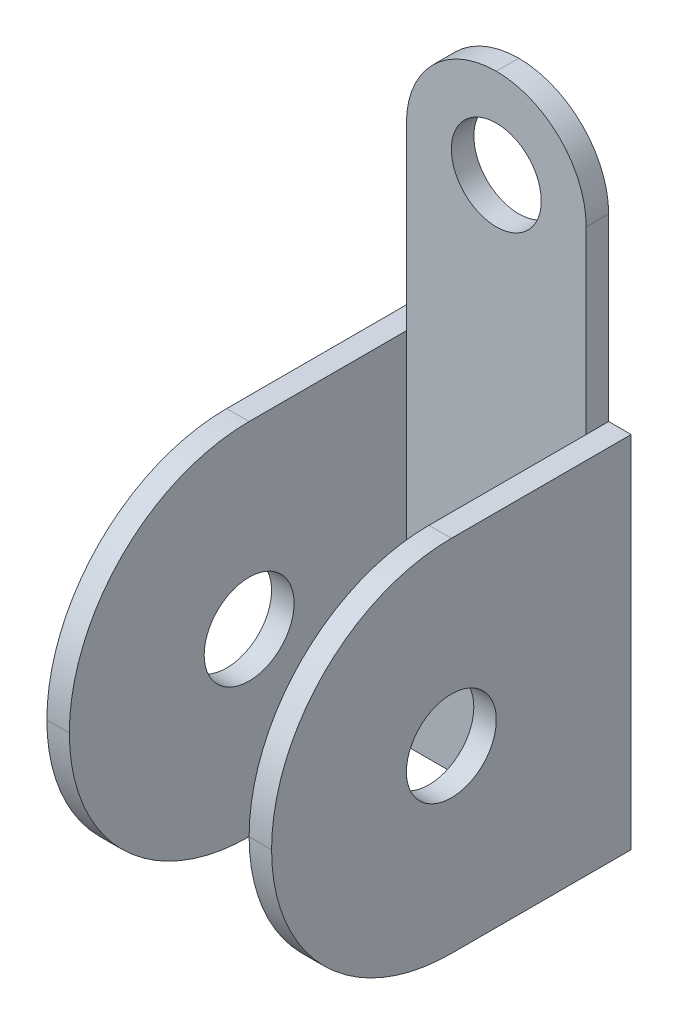
ISO-10303-21;
HEADER;
FILE_DESCRIPTION(('STEP AP214'),'2;1');
FILE_NAME('part.step','',(''),(''),'','','');
FILE_SCHEMA(('AUTOMOTIVE_DESIGN { 1 0 10303 214 1 1 1 1 }'));
ENDSEC;
DATA;
#1=APPLICATION_CONTEXT('core data for automotive mechanical design processes');
#2=APPLICATION_PROTOCOL_DEFINITION('international standard','automotive_design',2000,#1);
#3=PRODUCT_CONTEXT('',#1,'mechanical');
#4=PRODUCT('Part','Part','',(#3));
#5=PRODUCT_RELATED_PRODUCT_CATEGORY('part','',(#4));
#6=PRODUCT_DEFINITION_FORMATION('','',#4);
#7=PRODUCT_DEFINITION_CONTEXT('part definition',#1,'design');
#8=PRODUCT_DEFINITION('design','',#6,#7);
#9=PRODUCT_DEFINITION_SHAPE('','',#8);
#10=(LENGTH_UNIT() NAMED_UNIT(*) SI_UNIT(.MILLI.,.METRE.));
#11=(NAMED_UNIT(*) PLANE_ANGLE_UNIT() SI_UNIT($,.RADIAN.));
#12=(NAMED_UNIT(*) SI_UNIT($,.STERADIAN.) SOLID_ANGLE_UNIT());
#13=UNCERTAINTY_MEASURE_WITH_UNIT(LENGTH_MEASURE(1.E-05),#10,'distance_accuracy_value','');
#14=(GEOMETRIC_REPRESENTATION_CONTEXT(3) GLOBAL_UNCERTAINTY_ASSIGNED_CONTEXT((#13)) GLOBAL_UNIT_ASSIGNED_CONTEXT((#10,
#11,#12)) REPRESENTATION_CONTEXT('',''));
#15=CARTESIAN_POINT('',(0.,0.,0.));
#16=DIRECTION('',(0.,0.,1.));
#17=DIRECTION('',(1.,0.,0.));
#18=AXIS2_PLACEMENT_3D('',#15,#16,#17);
#19=CARTESIAN_POINT('',(6.35,0.,1.5875));
#20=DIRECTION('',(1.,0.,0.));
#21=DIRECTION('',(0.,0.,-1.));
#22=AXIS2_PLACEMENT_3D('',#19,#20,#21);
#23=PLANE('',#22);
#24=DIRECTION('',(0.,-1.,0.));
#25=VECTOR('',#24,1.);
#26=CARTESIAN_POINT('',(6.35,0.,0.));
#27=LINE('',#26,#25);
#28=CARTESIAN_POINT('',(6.35,25.4,0.));
#29=VERTEX_POINT('',#28);
#30=CARTESIAN_POINT('',(6.35,12.7,0.));
#31=VERTEX_POINT('',#30);
#32=EDGE_CURVE('E214',#29,#31,#27,.T.);
#33=ORIENTED_EDGE('',*,*,#32,.F.);
#34=DIRECTION('',(0.,0.,-1.));
#35=VECTOR('',#34,1.);
#36=CARTESIAN_POINT('',(6.35,25.4,1.5875));
#37=LINE('',#36,#35);
#38=CARTESIAN_POINT('',(6.35,25.4,1.5875));
#39=VERTEX_POINT('',#38);
#40=EDGE_CURVE('E11',#29,#39,#37,.F.);
#41=ORIENTED_EDGE('',*,*,#40,.T.);
#42=DIRECTION('',(0.,-1.,0.));
#43=VECTOR('',#42,1.);
#44=CARTESIAN_POINT('',(6.35,0.,1.5875));
#45=LINE('',#44,#43);
#46=CARTESIAN_POINT('',(6.35,12.7,1.5875));
#47=VERTEX_POINT('',#46);
#48=EDGE_CURVE('E215',#39,#47,#45,.T.);
#49=ORIENTED_EDGE('',*,*,#48,.T.);
#50=DIRECTION('',(0.,0.,-1.));
#51=VECTOR('',#50,1.);
#52=CARTESIAN_POINT('',(6.35,12.7,25.4));
#53=LINE('',#52,#51);
#54=EDGE_CURVE('E194',#47,#31,#53,.T.);
#55=ORIENTED_EDGE('',*,*,#54,.T.);
#56=EDGE_LOOP('',(#33,#41,#49,#55));
#57=FACE_BOUND('',#56,.T.);
#58=ADVANCED_FACE('F41',(#57),#23,.T.);
#59=CARTESIAN_POINT('',(-6.35,0.,1.5875));
#60=DIRECTION('',(1.,0.,0.));
#61=DIRECTION('',(0.,0.,-1.));
#62=AXIS2_PLACEMENT_3D('',#59,#60,#61);
#63=PLANE('',#62);
#64=DIRECTION('',(0.,-1.,0.));
#65=VECTOR('',#64,1.);
#66=CARTESIAN_POINT('',(-6.35,0.,1.5875));
#67=LINE('',#66,#65);
#68=CARTESIAN_POINT('',(-6.35,25.4,1.5875));
#69=VERTEX_POINT('',#68);
#70=CARTESIAN_POINT('',(-6.35,12.7,1.5875));
#71=VERTEX_POINT('',#70);
#72=EDGE_CURVE('E220',#69,#71,#67,.T.);
#73=ORIENTED_EDGE('',*,*,#72,.F.);
#74=DIRECTION('',(0.,0.,-1.));
#75=VECTOR('',#74,1.);
#76=CARTESIAN_POINT('',(-6.35,25.4,0.));
#77=LINE('',#76,#75);
#78=CARTESIAN_POINT('',(-6.35,25.4,0.));
#79=VERTEX_POINT('',#78);
#80=EDGE_CURVE('E273',#69,#79,#77,.T.);
#81=ORIENTED_EDGE('',*,*,#80,.T.);
#82=DIRECTION('',(0.,-1.,0.));
#83=VECTOR('',#82,1.);
#84=CARTESIAN_POINT('',(-6.35,0.,0.));
#85=LINE('',#84,#83);
#86=CARTESIAN_POINT('',(-6.35,12.7,0.));
#87=VERTEX_POINT('',#86);
#88=EDGE_CURVE('E170',#79,#87,#85,.T.);
#89=ORIENTED_EDGE('',*,*,#88,.T.);
#90=DIRECTION('',(0.,0.,-1.));
#91=VECTOR('',#90,1.);
#92=CARTESIAN_POINT('',(-6.35,12.7,25.4));
#93=LINE('',#92,#91);
#94=EDGE_CURVE('E206',#71,#87,#93,.T.);
#95=ORIENTED_EDGE('',*,*,#94,.F.);
#96=EDGE_LOOP('',(#73,#81,#89,#95));
#97=FACE_BOUND('',#96,.T.);
#98=ADVANCED_FACE('F305',(#97),#63,.F.);
#99=CARTESIAN_POINT('',(0.,-12.7,1.5875));
#100=DIRECTION('',(0.,-1.,0.));
#101=DIRECTION('',(1.,0.,0.));
#102=AXIS2_PLACEMENT_3D('',#99,#100,#101);
#103=PLANE('',#102);
#104=DIRECTION('',(0.,0.,-1.));
#105=VECTOR('',#104,1.);
#106=CARTESIAN_POINT('',(-6.35,-12.7,25.4));
#107=LINE('',#106,#105);
#108=CARTESIAN_POINT('',(-6.35,-12.7,12.7));
#109=VERTEX_POINT('',#108);
#110=CARTESIAN_POINT('',(-6.35,-12.7,1.5875));
#111=VERTEX_POINT('',#110);
#112=EDGE_CURVE('E205',#109,#111,#107,.T.);
#113=ORIENTED_EDGE('',*,*,#112,.F.);
#114=DIRECTION('',(-1.,0.,0.));
#115=VECTOR('',#114,1.);
#116=CARTESIAN_POINT('',(0.,-12.7,12.7));
#117=LINE('',#116,#115);
#118=CARTESIAN_POINT('',(-7.9375,-12.7,12.7));
#119=VERTEX_POINT('',#118);
#120=EDGE_CURVE('E241',#109,#119,#117,.T.);
#121=ORIENTED_EDGE('',*,*,#120,.T.);
#122=DIRECTION('',(0.,0.,-1.));
#123=VECTOR('',#122,1.);
#124=CARTESIAN_POINT('',(-7.9375,-12.7,25.4));
#125=LINE('',#124,#123);
#126=CARTESIAN_POINT('',(-7.9375,-12.7,0.));
#127=VERTEX_POINT('',#126);
#128=EDGE_CURVE('E164',#119,#127,#125,.T.);
#129=ORIENTED_EDGE('',*,*,#128,.T.);
#130=DIRECTION('',(-1.,0.,0.));
#131=VECTOR('',#130,1.);
#132=CARTESIAN_POINT('',(0.,-12.7,0.));
#133=LINE('',#132,#131);
#134=CARTESIAN_POINT('',(7.9375,-12.7,0.));
#135=VERTEX_POINT('',#134);
#136=EDGE_CURVE('E159',#135,#127,#133,.T.);
#137=ORIENTED_EDGE('',*,*,#136,.F.);
#138=DIRECTION('',(0.,0.,-1.));
#139=VECTOR('',#138,1.);
#140=CARTESIAN_POINT('',(7.9375,-12.7,25.4));
#141=LINE('',#140,#139);
#142=CARTESIAN_POINT('',(7.9375,-12.7,12.7));
#143=VERTEX_POINT('',#142);
#144=EDGE_CURVE('E143',#143,#135,#141,.T.);
#145=ORIENTED_EDGE('',*,*,#144,.F.);
#146=DIRECTION('',(-1.,0.,0.));
#147=VECTOR('',#146,1.);
#148=CARTESIAN_POINT('',(0.,-12.7,12.7));
#149=LINE('',#148,#147);
#150=CARTESIAN_POINT('',(6.35,-12.7,12.7));
#151=VERTEX_POINT('',#150);
#152=EDGE_CURVE('E238',#143,#151,#149,.T.);
#153=ORIENTED_EDGE('',*,*,#152,.T.);
#154=DIRECTION('',(0.,0.,-1.));
#155=VECTOR('',#154,1.);
#156=CARTESIAN_POINT('',(6.35,-12.7,25.4));
#157=LINE('',#156,#155);
#158=CARTESIAN_POINT('',(6.35,-12.7,1.5875));
#159=VERTEX_POINT('',#158);
#160=EDGE_CURVE('E155',#151,#159,#157,.T.);
#161=ORIENTED_EDGE('',*,*,#160,.T.);
#162=DIRECTION('',(-1.,0.,0.));
#163=VECTOR('',#162,1.);
#164=CARTESIAN_POINT('',(0.,-12.7,1.5875));
#165=LINE('',#164,#163);
#166=EDGE_CURVE('E223',#159,#111,#165,.T.);
#167=ORIENTED_EDGE('',*,*,#166,.T.);
#168=EDGE_LOOP('',(#113,#121,#129,#137,#145,#153,#161,#167));
#169=FACE_BOUND('',#168,.T.);
#170=ADVANCED_FACE('F161',(#169),#103,.T.);
#171=CARTESIAN_POINT('',(0.,25.4,1.5875));
#172=DIRECTION('',(0.,0.,-1.));
#173=DIRECTION('',(-1.,0.,0.));
#174=AXIS2_PLACEMENT_3D('',#171,#172,#173);
#175=CYLINDRICAL_SURFACE('',#174,3.175);
#176=CARTESIAN_POINT('',(0.,25.4,1.5875));
#177=DIRECTION('',(0.,0.,1.));
#178=DIRECTION('',(1.,0.,0.));
#179=AXIS2_PLACEMENT_3D('',#176,#177,#178);
#180=CIRCLE('',#179,3.175);
#181=CARTESIAN_POINT('',(3.175,25.4,1.5875));
#182=VERTEX_POINT('',#181);
#183=EDGE_CURVE('E227',#182,#182,#180,.T.);
#184=ORIENTED_EDGE('',*,*,#183,.T.);
#185=EDGE_LOOP('',(#184));
#186=FACE_BOUND('',#185,.T.);
#187=CARTESIAN_POINT('',(0.,25.4,0.));
#188=DIRECTION('',(0.,0.,1.));
#189=DIRECTION('',(1.,0.,0.));
#190=AXIS2_PLACEMENT_3D('',#187,#188,#189);
#191=CIRCLE('',#190,3.175);
#192=CARTESIAN_POINT('',(3.175,25.4,0.));
#193=VERTEX_POINT('',#192);
#194=EDGE_CURVE('E169',#193,#193,#191,.T.);
#195=ORIENTED_EDGE('',*,*,#194,.F.);
#196=EDGE_LOOP('',(#195));
#197=FACE_BOUND('',#196,.T.);
#198=ADVANCED_FACE('F417',(#186,#197),#175,.F.);
#199=CARTESIAN_POINT('',(0.,0.,1.5875));
#200=DIRECTION('',(0.,0.,1.));
#201=DIRECTION('',(1.,0.,0.));
#202=AXIS2_PLACEMENT_3D('',#199,#200,#201);
#203=PLANE('',#202);
#204=CARTESIAN_POINT('',(0.,25.4,1.5875));
#205=DIRECTION('',(0.,0.,1.));
#206=DIRECTION('',(1.,0.,0.));
#207=AXIS2_PLACEMENT_3D('',#204,#205,#206);
#208=CIRCLE('',#207,6.35);
#209=CARTESIAN_POINT('',(0.,31.75,1.5875));
#210=VERTEX_POINT('',#209);
#211=EDGE_CURVE('E58',#39,#210,#208,.T.);
#212=ORIENTED_EDGE('',*,*,#211,.T.);
#213=CARTESIAN_POINT('',(0.,25.4,1.5875));
#214=DIRECTION('',(0.,0.,1.));
#215=DIRECTION('',(1.,0.,0.));
#216=AXIS2_PLACEMENT_3D('',#213,#214,#215);
#217=CIRCLE('',#216,6.35);
#218=EDGE_CURVE('E51',#210,#69,#217,.T.);
#219=ORIENTED_EDGE('',*,*,#218,.T.);
#220=ORIENTED_EDGE('',*,*,#72,.T.);
#221=EDGE_CURVE('E218',#71,#111,#67,.T.);
#222=ORIENTED_EDGE('',*,*,#221,.T.);
#223=ORIENTED_EDGE('',*,*,#166,.F.);
#224=EDGE_CURVE('E219',#47,#159,#45,.T.);
#225=ORIENTED_EDGE('',*,*,#224,.F.);
#226=ORIENTED_EDGE('',*,*,#48,.F.);
#227=EDGE_LOOP('',(#212,#219,#220,#222,#223,#225,#226));
#228=FACE_BOUND('',#227,.T.);
#229=ORIENTED_EDGE('',*,*,#183,.F.);
#230=EDGE_LOOP('',(#229));
#231=FACE_BOUND('',#230,.T.);
#232=ADVANCED_FACE('F297',(#228,#231),#203,.T.);
#233=CARTESIAN_POINT('',(0.,0.,0.));
#234=DIRECTION('',(0.,0.,1.));
#235=DIRECTION('',(1.,0.,0.));
#236=AXIS2_PLACEMENT_3D('',#233,#234,#235);
#237=PLANE('',#236);
#238=ORIENTED_EDGE('',*,*,#88,.F.);
#239=CARTESIAN_POINT('',(0.,25.4,0.));
#240=DIRECTION('',(0.,0.,1.));
#241=DIRECTION('',(1.,0.,0.));
#242=AXIS2_PLACEMENT_3D('',#239,#240,#241);
#243=CIRCLE('',#242,6.35);
#244=CARTESIAN_POINT('',(0.,31.75,0.));
#245=VERTEX_POINT('',#244);
#246=EDGE_CURVE('E289',#79,#245,#243,.F.);
#247=ORIENTED_EDGE('',*,*,#246,.T.);
#248=CARTESIAN_POINT('',(0.,25.4,0.));
#249=DIRECTION('',(0.,0.,1.));
#250=DIRECTION('',(1.,0.,0.));
#251=AXIS2_PLACEMENT_3D('',#248,#249,#250);
#252=CIRCLE('',#251,6.35);
#253=EDGE_CURVE('E286',#245,#29,#252,.F.);
#254=ORIENTED_EDGE('',*,*,#253,.T.);
#255=ORIENTED_EDGE('',*,*,#32,.T.);
#256=DIRECTION('',(-1.,0.,0.));
#257=VECTOR('',#256,1.);
#258=CARTESIAN_POINT('',(0.,12.7,0.));
#259=LINE('',#258,#257);
#260=CARTESIAN_POINT('',(7.9375,12.7,0.));
#261=VERTEX_POINT('',#260);
#262=EDGE_CURVE('E177',#261,#31,#259,.T.);
#263=ORIENTED_EDGE('',*,*,#262,.F.);
#264=DIRECTION('',(0.,-1.,0.));
#265=VECTOR('',#264,1.);
#266=CARTESIAN_POINT('',(7.9375,0.,0.));
#267=LINE('',#266,#265);
#268=EDGE_CURVE('E148',#261,#135,#267,.T.);
#269=ORIENTED_EDGE('',*,*,#268,.T.);
#270=ORIENTED_EDGE('',*,*,#136,.T.);
#271=DIRECTION('',(0.,-1.,0.));
#272=VECTOR('',#271,1.);
#273=CARTESIAN_POINT('',(-7.9375,0.,0.));
#274=LINE('',#273,#272);
#275=CARTESIAN_POINT('',(-7.9375,12.7,0.));
#276=VERTEX_POINT('',#275);
#277=EDGE_CURVE('E198',#276,#127,#274,.T.);
#278=ORIENTED_EDGE('',*,*,#277,.F.);
#279=DIRECTION('',(-1.,0.,0.));
#280=VECTOR('',#279,1.);
#281=CARTESIAN_POINT('',(0.,12.7,0.));
#282=LINE('',#281,#280);
#283=EDGE_CURVE('E193',#87,#276,#282,.T.);
#284=ORIENTED_EDGE('',*,*,#283,.F.);
#285=EDGE_LOOP('',(#238,#247,#254,#255,#263,#269,#270,#278,#284));
#286=FACE_BOUND('',#285,.T.);
#287=ORIENTED_EDGE('',*,*,#194,.T.);
#288=EDGE_LOOP('',(#287));
#289=FACE_BOUND('',#288,.T.);
#290=ADVANCED_FACE('F174',(#286,#289),#237,.F.);
#291=CARTESIAN_POINT('',(-6.35,0.,25.4));
#292=DIRECTION('',(1.,0.,0.));
#293=DIRECTION('',(0.,0.,-1.));
#294=AXIS2_PLACEMENT_3D('',#291,#292,#293);
#295=PLANE('',#294);
#296=CARTESIAN_POINT('',(-6.35,0.,12.7));
#297=DIRECTION('',(1.,0.,0.));
#298=DIRECTION('',(0.,0.,-1.));
#299=AXIS2_PLACEMENT_3D('',#296,#297,#298);
#300=CIRCLE('',#299,3.175);
#301=CARTESIAN_POINT('',(-6.35,0.,9.525));
#302=VERTEX_POINT('',#301);
#303=EDGE_CURVE('E183',#302,#302,#300,.T.);
#304=ORIENTED_EDGE('',*,*,#303,.F.);
#305=EDGE_LOOP('',(#304));
#306=FACE_BOUND('',#305,.T.);
#307=CARTESIAN_POINT('',(-6.35,0.,12.7));
#308=DIRECTION('',(1.,0.,0.));
#309=DIRECTION('',(0.,0.,-1.));
#310=AXIS2_PLACEMENT_3D('',#307,#308,#309);
#311=CIRCLE('',#310,12.7);
#312=CARTESIAN_POINT('',(-6.35,12.7,12.7));
#313=VERTEX_POINT('',#312);
#314=CARTESIAN_POINT('',(-6.35,0.,25.4));
#315=VERTEX_POINT('',#314);
#316=EDGE_CURVE('E250',#313,#315,#311,.T.);
#317=ORIENTED_EDGE('',*,*,#316,.T.);
#318=CARTESIAN_POINT('',(-6.35,0.,12.7));
#319=DIRECTION('',(1.,0.,0.));
#320=DIRECTION('',(0.,0.,-1.));
#321=AXIS2_PLACEMENT_3D('',#318,#319,#320);
#322=CIRCLE('',#321,12.7);
#323=EDGE_CURVE('E253',#315,#109,#322,.T.);
#324=ORIENTED_EDGE('',*,*,#323,.T.);
#325=ORIENTED_EDGE('',*,*,#112,.T.);
#326=ORIENTED_EDGE('',*,*,#221,.F.);
#327=EDGE_CURVE('E201',#313,#71,#93,.T.);
#328=ORIENTED_EDGE('',*,*,#327,.F.);
#329=EDGE_LOOP('',(#317,#324,#325,#326,#328));
#330=FACE_BOUND('',#329,.T.);
#331=ADVANCED_FACE('F331',(#306,#330),#295,.T.);
#332=CARTESIAN_POINT('',(0.,12.7,25.4));
#333=DIRECTION('',(0.,-1.,0.));
#334=DIRECTION('',(1.,0.,0.));
#335=AXIS2_PLACEMENT_3D('',#332,#333,#334);
#336=PLANE('',#335);
#337=DIRECTION('',(0.,0.,-1.));
#338=VECTOR('',#337,1.);
#339=CARTESIAN_POINT('',(-7.9375,12.7,25.4));
#340=LINE('',#339,#338);
#341=CARTESIAN_POINT('',(-7.9375,12.7,12.7));
#342=VERTEX_POINT('',#341);
#343=EDGE_CURVE('E211',#342,#276,#340,.T.);
#344=ORIENTED_EDGE('',*,*,#343,.F.);
#345=DIRECTION('',(-1.,0.,0.));
#346=VECTOR('',#345,1.);
#347=CARTESIAN_POINT('',(-6.35,12.7,12.7));
#348=LINE('',#347,#346);
#349=EDGE_CURVE('E270',#342,#313,#348,.F.);
#350=ORIENTED_EDGE('',*,*,#349,.T.);
#351=ORIENTED_EDGE('',*,*,#327,.T.);
#352=ORIENTED_EDGE('',*,*,#94,.T.);
#353=ORIENTED_EDGE('',*,*,#283,.T.);
#354=EDGE_LOOP('',(#344,#350,#351,#352,#353));
#355=FACE_BOUND('',#354,.T.);
#356=ADVANCED_FACE('F334',(#355),#336,.F.);
#357=CARTESIAN_POINT('',(-7.9375,0.,25.4));
#358=DIRECTION('',(1.,0.,0.));
#359=DIRECTION('',(0.,0.,-1.));
#360=AXIS2_PLACEMENT_3D('',#357,#358,#359);
#361=PLANE('',#360);
#362=CARTESIAN_POINT('',(-7.9375,0.,12.7));
#363=DIRECTION('',(-1.,0.,0.));
#364=DIRECTION('',(0.,0.,1.));
#365=AXIS2_PLACEMENT_3D('',#362,#363,#364);
#366=CIRCLE('',#365,3.175);
#367=CARTESIAN_POINT('',(-7.9375,0.,15.875));
#368=VERTEX_POINT('',#367);
#369=EDGE_CURVE('E278',#368,#368,#366,.T.);
#370=ORIENTED_EDGE('',*,*,#369,.F.);
#371=EDGE_LOOP('',(#370));
#372=FACE_BOUND('',#371,.T.);
#373=ORIENTED_EDGE('',*,*,#128,.F.);
#374=CARTESIAN_POINT('',(-7.9375,0.,12.7));
#375=DIRECTION('',(1.,0.,0.));
#376=DIRECTION('',(0.,0.,-1.));
#377=AXIS2_PLACEMENT_3D('',#374,#375,#376);
#378=CIRCLE('',#377,12.7);
#379=CARTESIAN_POINT('',(-7.9375,0.,25.4));
#380=VERTEX_POINT('',#379);
#381=EDGE_CURVE('E247',#119,#380,#378,.F.);
#382=ORIENTED_EDGE('',*,*,#381,.T.);
#383=CARTESIAN_POINT('',(-7.9375,0.,12.7));
#384=DIRECTION('',(1.,0.,0.));
#385=DIRECTION('',(0.,0.,-1.));
#386=AXIS2_PLACEMENT_3D('',#383,#384,#385);
#387=CIRCLE('',#386,12.7);
#388=EDGE_CURVE('E244',#380,#342,#387,.F.);
#389=ORIENTED_EDGE('',*,*,#388,.T.);
#390=ORIENTED_EDGE('',*,*,#343,.T.);
#391=ORIENTED_EDGE('',*,*,#277,.T.);
#392=EDGE_LOOP('',(#373,#382,#389,#390,#391));
#393=FACE_BOUND('',#392,.T.);
#394=ADVANCED_FACE('F348',(#372,#393),#361,.F.);
#395=CARTESIAN_POINT('',(6.35,0.,25.4));
#396=DIRECTION('',(1.,0.,0.));
#397=DIRECTION('',(0.,0.,-1.));
#398=AXIS2_PLACEMENT_3D('',#395,#396,#397);
#399=PLANE('',#398);
#400=CARTESIAN_POINT('',(6.35,0.,12.7));
#401=DIRECTION('',(1.,0.,0.));
#402=DIRECTION('',(0.,0.,-1.));
#403=AXIS2_PLACEMENT_3D('',#400,#401,#402);
#404=CIRCLE('',#403,3.175);
#405=CARTESIAN_POINT('',(6.35,0.,9.525));
#406=VERTEX_POINT('',#405);
#407=EDGE_CURVE('E320',#406,#406,#404,.T.);
#408=ORIENTED_EDGE('',*,*,#407,.T.);
#409=EDGE_LOOP('',(#408));
#410=FACE_BOUND('',#409,.T.);
#411=ORIENTED_EDGE('',*,*,#160,.F.);
#412=CARTESIAN_POINT('',(6.35,0.,12.7));
#413=DIRECTION('',(1.,0.,0.));
#414=DIRECTION('',(0.,0.,-1.));
#415=AXIS2_PLACEMENT_3D('',#412,#413,#414);
#416=CIRCLE('',#415,12.7);
#417=CARTESIAN_POINT('',(6.35,0.,25.4));
#418=VERTEX_POINT('',#417);
#419=EDGE_CURVE('E259',#151,#418,#416,.F.);
#420=ORIENTED_EDGE('',*,*,#419,.T.);
#421=CARTESIAN_POINT('',(6.35,0.,12.7));
#422=DIRECTION('',(1.,0.,0.));
#423=DIRECTION('',(0.,0.,-1.));
#424=AXIS2_PLACEMENT_3D('',#421,#422,#423);
#425=CIRCLE('',#424,12.7);
#426=CARTESIAN_POINT('',(6.35,12.7,12.7));
#427=VERTEX_POINT('',#426);
#428=EDGE_CURVE('E256',#418,#427,#425,.F.);
#429=ORIENTED_EDGE('',*,*,#428,.T.);
#430=EDGE_CURVE('E189',#427,#47,#53,.T.);
#431=ORIENTED_EDGE('',*,*,#430,.T.);
#432=ORIENTED_EDGE('',*,*,#224,.T.);
#433=EDGE_LOOP('',(#411,#420,#429,#431,#432));
#434=FACE_BOUND('',#433,.T.);
#435=ADVANCED_FACE('F366',(#410,#434),#399,.F.);
#436=CARTESIAN_POINT('',(0.,12.7,25.4));
#437=DIRECTION('',(0.,-1.,0.));
#438=DIRECTION('',(1.,0.,0.));
#439=AXIS2_PLACEMENT_3D('',#436,#437,#438);
#440=PLANE('',#439);
#441=ORIENTED_EDGE('',*,*,#430,.F.);
#442=DIRECTION('',(-1.,0.,0.));
#443=VECTOR('',#442,1.);
#444=CARTESIAN_POINT('',(7.9375,12.7,12.7));
#445=LINE('',#444,#443);
#446=CARTESIAN_POINT('',(7.9375,12.7,12.7));
#447=VERTEX_POINT('',#446);
#448=EDGE_CURVE('E267',#427,#447,#445,.F.);
#449=ORIENTED_EDGE('',*,*,#448,.T.);
#450=DIRECTION('',(0.,0.,-1.));
#451=VECTOR('',#450,1.);
#452=CARTESIAN_POINT('',(7.9375,12.7,25.4));
#453=LINE('',#452,#451);
#454=EDGE_CURVE('E156',#447,#261,#453,.T.);
#455=ORIENTED_EDGE('',*,*,#454,.T.);
#456=ORIENTED_EDGE('',*,*,#262,.T.);
#457=ORIENTED_EDGE('',*,*,#54,.F.);
#458=EDGE_LOOP('',(#441,#449,#455,#456,#457));
#459=FACE_BOUND('',#458,.T.);
#460=ADVANCED_FACE('F358',(#459),#440,.F.);
#461=CARTESIAN_POINT('',(7.9375,0.,25.4));
#462=DIRECTION('',(1.,0.,0.));
#463=DIRECTION('',(0.,0.,-1.));
#464=AXIS2_PLACEMENT_3D('',#461,#462,#463);
#465=PLANE('',#464);
#466=CARTESIAN_POINT('',(7.9375,0.,12.7));
#467=DIRECTION('',(-1.,0.,0.));
#468=DIRECTION('',(0.,0.,1.));
#469=AXIS2_PLACEMENT_3D('',#466,#467,#468);
#470=CIRCLE('',#469,3.175);
#471=CARTESIAN_POINT('',(7.9375,0.,15.875));
#472=VERTEX_POINT('',#471);
#473=EDGE_CURVE('E316',#472,#472,#470,.T.);
#474=ORIENTED_EDGE('',*,*,#473,.T.);
#475=EDGE_LOOP('',(#474));
#476=FACE_BOUND('',#475,.T.);
#477=CARTESIAN_POINT('',(7.9375,0.,12.7));
#478=DIRECTION('',(1.,0.,0.));
#479=DIRECTION('',(0.,0.,-1.));
#480=AXIS2_PLACEMENT_3D('',#477,#478,#479);
#481=CIRCLE('',#480,12.7);
#482=CARTESIAN_POINT('',(7.9375,0.,25.4));
#483=VERTEX_POINT('',#482);
#484=EDGE_CURVE('E262',#447,#483,#481,.T.);
#485=ORIENTED_EDGE('',*,*,#484,.T.);
#486=CARTESIAN_POINT('',(7.9375,0.,12.7));
#487=DIRECTION('',(1.,0.,0.));
#488=DIRECTION('',(0.,0.,-1.));
#489=AXIS2_PLACEMENT_3D('',#486,#487,#488);
#490=CIRCLE('',#489,12.7);
#491=EDGE_CURVE('E150',#483,#143,#490,.T.);
#492=ORIENTED_EDGE('',*,*,#491,.T.);
#493=ORIENTED_EDGE('',*,*,#144,.T.);
#494=ORIENTED_EDGE('',*,*,#268,.F.);
#495=ORIENTED_EDGE('',*,*,#454,.F.);
#496=EDGE_LOOP('',(#485,#492,#493,#494,#495));
#497=FACE_BOUND('',#496,.T.);
#498=ADVANCED_FACE('F145',(#476,#497),#465,.T.);
#499=CARTESIAN_POINT('',(7.9375,0.,12.7));
#500=DIRECTION('',(-1.,0.,0.));
#501=DIRECTION('',(0.,0.,1.));
#502=AXIS2_PLACEMENT_3D('',#499,#500,#501);
#503=CYLINDRICAL_SURFACE('',#502,3.175);
#504=ORIENTED_EDGE('',*,*,#473,.F.);
#505=EDGE_LOOP('',(#504));
#506=FACE_BOUND('',#505,.T.);
#507=ORIENTED_EDGE('',*,*,#407,.F.);
#508=EDGE_LOOP('',(#507));
#509=FACE_BOUND('',#508,.T.);
#510=ADVANCED_FACE('F395',(#506,#509),#503,.F.);
#511=ORIENTED_EDGE('',*,*,#303,.T.);
#512=EDGE_LOOP('',(#511));
#513=FACE_BOUND('',#512,.T.);
#514=ORIENTED_EDGE('',*,*,#369,.T.);
#515=EDGE_LOOP('',(#514));
#516=FACE_BOUND('',#515,.T.);
#517=ADVANCED_FACE('F328',(#513,#516),#503,.F.);
#518=CARTESIAN_POINT('',(0.,0.,12.7));
#519=DIRECTION('',(1.,0.,0.));
#520=DIRECTION('',(0.,1.,0.));
#521=AXIS2_PLACEMENT_3D('',#518,#519,#520);
#522=CYLINDRICAL_SURFACE('',#521,12.7);
#523=DIRECTION('',(-1.,0.,0.));
#524=VECTOR('',#523,1.);
#525=CARTESIAN_POINT('',(-7.9375,0.,25.4));
#526=LINE('',#525,#524);
#527=EDGE_CURVE('E274',#315,#380,#526,.T.);
#528=ORIENTED_EDGE('',*,*,#527,.F.);
#529=ORIENTED_EDGE('',*,*,#316,.F.);
#530=ORIENTED_EDGE('',*,*,#349,.F.);
#531=ORIENTED_EDGE('',*,*,#388,.F.);
#532=EDGE_LOOP('',(#528,#529,#530,#531));
#533=FACE_BOUND('',#532,.T.);
#534=ADVANCED_FACE('F343',(#533),#522,.T.);
#535=CARTESIAN_POINT('',(0.,0.,12.7));
#536=DIRECTION('',(-1.,0.,0.));
#537=DIRECTION('',(0.,-1.,0.));
#538=AXIS2_PLACEMENT_3D('',#535,#536,#537);
#539=CYLINDRICAL_SURFACE('',#538,12.7);
#540=ORIENTED_EDGE('',*,*,#323,.F.);
#541=ORIENTED_EDGE('',*,*,#527,.T.);
#542=ORIENTED_EDGE('',*,*,#381,.F.);
#543=ORIENTED_EDGE('',*,*,#120,.F.);
#544=EDGE_LOOP('',(#540,#541,#542,#543));
#545=FACE_BOUND('',#544,.T.);
#546=ADVANCED_FACE('F346',(#545),#539,.T.);
#547=CARTESIAN_POINT('',(0.,0.,12.7));
#548=DIRECTION('',(1.,0.,0.));
#549=DIRECTION('',(0.,1.,0.));
#550=AXIS2_PLACEMENT_3D('',#547,#548,#549);
#551=CYLINDRICAL_SURFACE('',#550,12.7);
#552=DIRECTION('',(-1.,0.,0.));
#553=VECTOR('',#552,1.);
#554=CARTESIAN_POINT('',(6.35,0.,25.4));
#555=LINE('',#554,#553);
#556=EDGE_CURVE('E279',#483,#418,#555,.T.);
#557=ORIENTED_EDGE('',*,*,#556,.F.);
#558=ORIENTED_EDGE('',*,*,#484,.F.);
#559=ORIENTED_EDGE('',*,*,#448,.F.);
#560=ORIENTED_EDGE('',*,*,#428,.F.);
#561=EDGE_LOOP('',(#557,#558,#559,#560));
#562=FACE_BOUND('',#561,.T.);
#563=ADVANCED_FACE('F371',(#562),#551,.T.);
#564=CARTESIAN_POINT('',(0.,0.,12.7));
#565=DIRECTION('',(-1.,0.,0.));
#566=DIRECTION('',(0.,-1.,0.));
#567=AXIS2_PLACEMENT_3D('',#564,#565,#566);
#568=CYLINDRICAL_SURFACE('',#567,12.7);
#569=ORIENTED_EDGE('',*,*,#491,.F.);
#570=ORIENTED_EDGE('',*,*,#556,.T.);
#571=ORIENTED_EDGE('',*,*,#419,.F.);
#572=ORIENTED_EDGE('',*,*,#152,.F.);
#573=EDGE_LOOP('',(#569,#570,#571,#572));
#574=FACE_BOUND('',#573,.T.);
#575=ADVANCED_FACE('F373',(#574),#568,.T.);
#576=CARTESIAN_POINT('',(0.,25.4,1.5875));
#577=DIRECTION('',(0.,0.,-1.));
#578=DIRECTION('',(-1.,0.,0.));
#579=AXIS2_PLACEMENT_3D('',#576,#577,#578);
#580=CYLINDRICAL_SURFACE('',#579,6.35);
#581=DIRECTION('',(0.,0.,-1.));
#582=VECTOR('',#581,1.);
#583=CARTESIAN_POINT('',(0.,31.75,1.5875));
#584=LINE('',#583,#582);
#585=EDGE_CURVE('E45',#210,#245,#584,.T.);
#586=ORIENTED_EDGE('',*,*,#585,.F.);
#587=ORIENTED_EDGE('',*,*,#211,.F.);
#588=ORIENTED_EDGE('',*,*,#40,.F.);
#589=ORIENTED_EDGE('',*,*,#253,.F.);
#590=EDGE_LOOP('',(#586,#587,#588,#589));
#591=FACE_BOUND('',#590,.T.);
#592=ADVANCED_FACE('F43',(#591),#580,.T.);
#593=CARTESIAN_POINT('',(0.,25.4,1.5875));
#594=DIRECTION('',(0.,0.,1.));
#595=DIRECTION('',(1.,0.,0.));
#596=AXIS2_PLACEMENT_3D('',#593,#594,#595);
#597=CYLINDRICAL_SURFACE('',#596,6.35);
#598=ORIENTED_EDGE('',*,*,#218,.F.);
#599=ORIENTED_EDGE('',*,*,#585,.T.);
#600=ORIENTED_EDGE('',*,*,#246,.F.);
#601=ORIENTED_EDGE('',*,*,#80,.F.);
#602=EDGE_LOOP('',(#598,#599,#600,#601));
#603=FACE_BOUND('',#602,.T.);
#604=ADVANCED_FACE('F308',(#603),#597,.T.);
#605=CLOSED_SHELL('',(#58,#98,#170,#198,#232,#290,#331,#356,#394,#435,#460,#498,#510,#517,#534,
#546,#563,#575,#592,#604));
#606=MANIFOLD_SOLID_BREP('B2',#605);
#607=ADVANCED_BREP_SHAPE_REPRESENTATION('',(#18,#606),#14);
#608=SHAPE_DEFINITION_REPRESENTATION(#9,#607);
ENDSEC;
END-ISO-10303-21;
